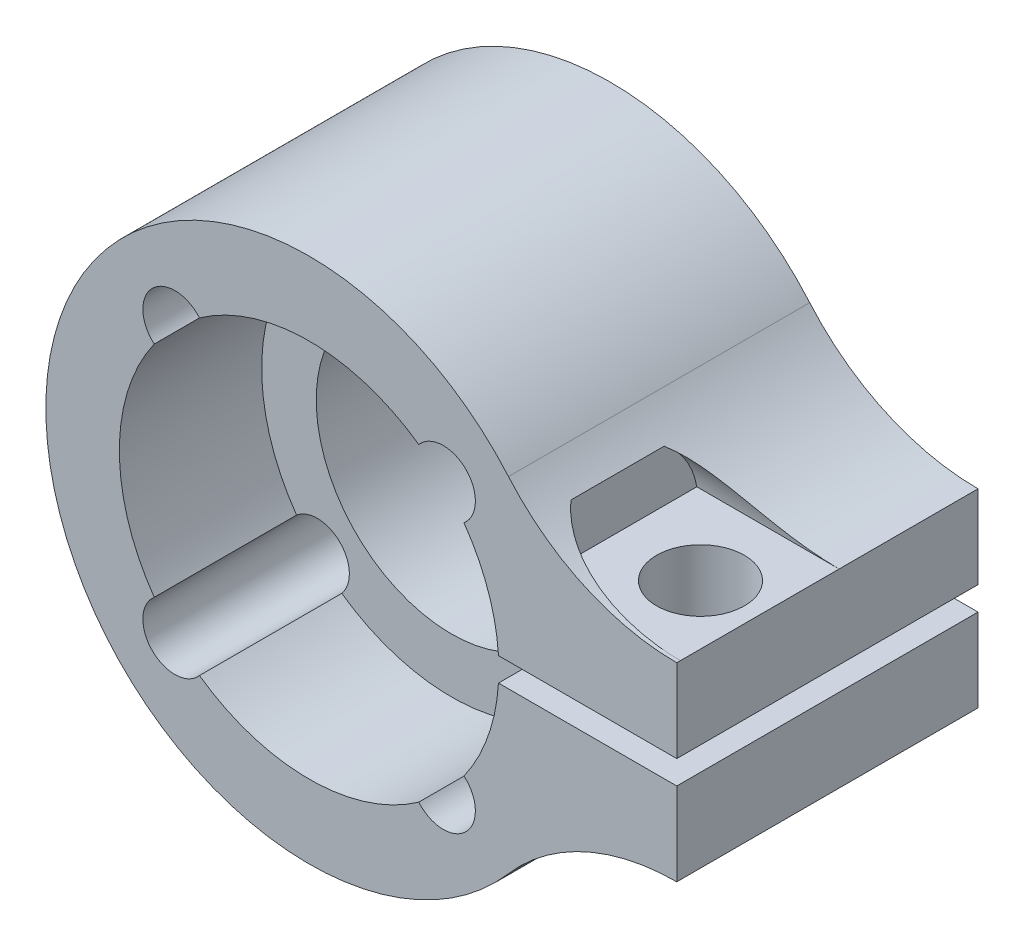
ISO-10303-21;
HEADER;
FILE_DESCRIPTION(('STEP AP214'),'2;1');
FILE_NAME('part.step','',(''),(''),'','','');
FILE_SCHEMA(('AUTOMOTIVE_DESIGN { 1 0 10303 214 1 1 1 1 }'));
ENDSEC;
DATA;
#1=APPLICATION_CONTEXT('core data for automotive mechanical design processes');
#2=APPLICATION_PROTOCOL_DEFINITION('international standard','automotive_design',2000,#1);
#3=PRODUCT_CONTEXT('',#1,'mechanical');
#4=PRODUCT('Part','Part','',(#3));
#5=PRODUCT_RELATED_PRODUCT_CATEGORY('part','',(#4));
#6=PRODUCT_DEFINITION_FORMATION('','',#4);
#7=PRODUCT_DEFINITION_CONTEXT('part definition',#1,'design');
#8=PRODUCT_DEFINITION('design','',#6,#7);
#9=PRODUCT_DEFINITION_SHAPE('','',#8);
#10=(LENGTH_UNIT() NAMED_UNIT(*) SI_UNIT(.MILLI.,.METRE.));
#11=(NAMED_UNIT(*) PLANE_ANGLE_UNIT() SI_UNIT($,.RADIAN.));
#12=(NAMED_UNIT(*) SI_UNIT($,.STERADIAN.) SOLID_ANGLE_UNIT());
#13=UNCERTAINTY_MEASURE_WITH_UNIT(LENGTH_MEASURE(1.E-05),#10,'distance_accuracy_value','');
#14=(GEOMETRIC_REPRESENTATION_CONTEXT(3) GLOBAL_UNCERTAINTY_ASSIGNED_CONTEXT((#13)) GLOBAL_UNIT_ASSIGNED_CONTEXT((#10,
#11,#12)) REPRESENTATION_CONTEXT('',''));
#15=CARTESIAN_POINT('',(0.,0.,0.));
#16=DIRECTION('',(0.,0.,1.));
#17=DIRECTION('',(1.,0.,0.));
#18=AXIS2_PLACEMENT_3D('',#15,#16,#17);
#19=CARTESIAN_POINT('',(0.,0.,-12.7));
#20=DIRECTION('',(0.,0.,1.));
#21=DIRECTION('',(1.,0.,0.));
#22=AXIS2_PLACEMENT_3D('',#19,#20,#21);
#23=CYLINDRICAL_SURFACE('',#22,8.00000000000004);
#24=CARTESIAN_POINT('',(0.,0.,-6.));
#25=DIRECTION('',(0.,0.,1.));
#26=DIRECTION('',(1.,0.,0.));
#27=AXIS2_PLACEMENT_3D('',#24,#25,#26);
#28=CIRCLE('',#27,8.);
#29=CARTESIAN_POINT('',(6.52895071917873,-4.62307284244316,-6.));
#30=VERTEX_POINT('',#29);
#31=CARTESIAN_POINT('',(7.98435971133566,-0.499999999999987,-6.));
#32=VERTEX_POINT('',#31);
#33=EDGE_CURVE('E198',#30,#32,#28,.T.);
#34=ORIENTED_EDGE('',*,*,#33,.F.);
#35=DIRECTION('',(0.,0.,-1.));
#36=VECTOR('',#35,1.);
#37=CARTESIAN_POINT('',(6.52895071917877,-4.62307284244318,-6.35));
#38=LINE('',#37,#36);
#39=CARTESIAN_POINT('',(6.5289507191788,-4.62307284244321,0.));
#40=VERTEX_POINT('',#39);
#41=EDGE_CURVE('E58',#30,#40,#38,.F.);
#42=ORIENTED_EDGE('',*,*,#41,.T.);
#43=CARTESIAN_POINT('',(0.,0.,0.));
#44=DIRECTION('',(0.,0.,1.));
#45=DIRECTION('',(1.,0.,0.));
#46=AXIS2_PLACEMENT_3D('',#43,#44,#45);
#47=CIRCLE('',#46,8.00000000000009);
#48=CARTESIAN_POINT('',(7.98435971133574,-0.500000000000003,0.));
#49=VERTEX_POINT('',#48);
#50=EDGE_CURVE('E196',#40,#49,#47,.T.);
#51=ORIENTED_EDGE('',*,*,#50,.T.);
#52=DIRECTION('',(0.,0.,-1.));
#53=VECTOR('',#52,1.);
#54=CARTESIAN_POINT('',(7.98435971133566,-0.499999999999975,0.));
#55=LINE('',#54,#53);
#56=EDGE_CURVE('E545',#32,#49,#55,.F.);
#57=ORIENTED_EDGE('',*,*,#56,.F.);
#58=EDGE_LOOP('',(#34,#42,#51,#57));
#59=FACE_BOUND('',#58,.T.);
#60=ADVANCED_FACE('F43',(#59),#23,.F.);
#61=CARTESIAN_POINT('',(0.,0.,0.));
#62=DIRECTION('',(0.,0.,1.));
#63=DIRECTION('',(1.,0.,0.));
#64=AXIS2_PLACEMENT_3D('',#61,#62,#63);
#65=PLANE('',#64);
#66=ORIENTED_EDGE('',*,*,#50,.F.);
#67=CARTESIAN_POINT('',(5.656854249492,-5.656854249492,0.));
#68=DIRECTION('',(0.,0.,-1.));
#69=DIRECTION('',(-1.,0.,0.));
#70=AXIS2_PLACEMENT_3D('',#67,#68,#69);
#71=CIRCLE('',#70,1.35249999999999);
#72=CARTESIAN_POINT('',(4.62307284244321,-6.5289507191788,0.));
#73=VERTEX_POINT('',#72);
#74=EDGE_CURVE('E183',#40,#73,#71,.T.);
#75=ORIENTED_EDGE('',*,*,#74,.T.);
#76=CARTESIAN_POINT('',(-4.62307284244321,-6.5289507191788,0.));
#77=VERTEX_POINT('',#76);
#78=EDGE_CURVE('E206',#77,#73,#47,.T.);
#79=ORIENTED_EDGE('',*,*,#78,.F.);
#80=CARTESIAN_POINT('',(-5.656854249492,-5.656854249492,0.));
#81=DIRECTION('',(0.,0.,-1.));
#82=DIRECTION('',(-1.,0.,0.));
#83=AXIS2_PLACEMENT_3D('',#80,#81,#82);
#84=CIRCLE('',#83,1.35249999999999);
#85=CARTESIAN_POINT('',(-6.5289507191788,-4.62307284244321,0.));
#86=VERTEX_POINT('',#85);
#87=EDGE_CURVE('E241',#77,#86,#84,.T.);
#88=ORIENTED_EDGE('',*,*,#87,.T.);
#89=CARTESIAN_POINT('',(-6.5289507191788,4.62307284244321,0.));
#90=VERTEX_POINT('',#89);
#91=EDGE_CURVE('E210',#90,#86,#47,.T.);
#92=ORIENTED_EDGE('',*,*,#91,.F.);
#93=CARTESIAN_POINT('',(-5.656854249492,5.656854249492,0.));
#94=DIRECTION('',(0.,0.,-1.));
#95=DIRECTION('',(-1.,0.,0.));
#96=AXIS2_PLACEMENT_3D('',#93,#94,#95);
#97=CIRCLE('',#96,1.35249999999999);
#98=CARTESIAN_POINT('',(-4.62307284244321,6.5289507191788,0.));
#99=VERTEX_POINT('',#98);
#100=EDGE_CURVE('E240',#90,#99,#97,.T.);
#101=ORIENTED_EDGE('',*,*,#100,.T.);
#102=CARTESIAN_POINT('',(4.62307284244318,6.52895071917877,0.));
#103=VERTEX_POINT('',#102);
#104=EDGE_CURVE('E217',#103,#99,#47,.T.);
#105=ORIENTED_EDGE('',*,*,#104,.F.);
#106=CARTESIAN_POINT('',(5.656854249492,5.656854249492,0.));
#107=DIRECTION('',(0.,0.,-1.));
#108=DIRECTION('',(-1.,0.,0.));
#109=AXIS2_PLACEMENT_3D('',#106,#107,#108);
#110=CIRCLE('',#109,1.35249999999999);
#111=CARTESIAN_POINT('',(6.52895071917877,4.62307284244318,0.));
#112=VERTEX_POINT('',#111);
#113=EDGE_CURVE('E258',#103,#112,#110,.T.);
#114=ORIENTED_EDGE('',*,*,#113,.T.);
#115=CARTESIAN_POINT('',(7.98435971133583,0.5,0.));
#116=VERTEX_POINT('',#115);
#117=EDGE_CURVE('E209',#116,#112,#47,.T.);
#118=ORIENTED_EDGE('',*,*,#117,.F.);
#119=DIRECTION('',(1.,0.,0.));
#120=VECTOR('',#119,1.);
#121=CARTESIAN_POINT('',(0.,0.5,0.));
#122=LINE('',#121,#120);
#123=CARTESIAN_POINT('',(15.5,0.5,0.));
#124=VERTEX_POINT('',#123);
#125=EDGE_CURVE('E734',#116,#124,#122,.T.);
#126=ORIENTED_EDGE('',*,*,#125,.T.);
#127=DIRECTION('',(0.,1.,0.));
#128=VECTOR('',#127,1.);
#129=CARTESIAN_POINT('',(15.5,0.,0.));
#130=LINE('',#129,#128);
#131=CARTESIAN_POINT('',(15.5,4.000000000003,0.));
#132=VERTEX_POINT('',#131);
#133=EDGE_CURVE('E519',#124,#132,#130,.T.);
#134=ORIENTED_EDGE('',*,*,#133,.T.);
#135=CARTESIAN_POINT('',(15.5,13.36901408451,0.));
#136=DIRECTION('',(0.,0.,1.));
#137=DIRECTION('',(1.,0.,0.));
#138=AXIS2_PLACEMENT_3D('',#135,#136,#137);
#139=CIRCLE('',#138,9.369014084507);
#140=CARTESIAN_POINT('',(8.40538773825106,7.24979013280251,0.));
#141=VERTEX_POINT('',#140);
#142=EDGE_CURVE('E523',#132,#141,#139,.F.);
#143=ORIENTED_EDGE('',*,*,#142,.T.);
#144=CARTESIAN_POINT('',(0.,0.,0.));
#145=DIRECTION('',(0.,0.,1.));
#146=DIRECTION('',(1.,0.,0.));
#147=AXIS2_PLACEMENT_3D('',#144,#145,#146);
#148=CIRCLE('',#147,11.1);
#149=CARTESIAN_POINT('',(8.4053877382513,-7.24979013280223,0.));
#150=VERTEX_POINT('',#149);
#151=EDGE_CURVE('E478',#150,#141,#148,.F.);
#152=ORIENTED_EDGE('',*,*,#151,.F.);
#153=CARTESIAN_POINT('',(15.5,-13.36901408451,0.));
#154=DIRECTION('',(0.,0.,1.));
#155=DIRECTION('',(1.,0.,0.));
#156=AXIS2_PLACEMENT_3D('',#153,#154,#155);
#157=CIRCLE('',#156,9.369014084507);
#158=CARTESIAN_POINT('',(15.5,-4.000000000003,0.));
#159=VERTEX_POINT('',#158);
#160=EDGE_CURVE('E503',#150,#159,#157,.F.);
#161=ORIENTED_EDGE('',*,*,#160,.T.);
#162=DIRECTION('',(0.,1.,0.));
#163=VECTOR('',#162,1.);
#164=CARTESIAN_POINT('',(15.5,0.,0.));
#165=LINE('',#164,#163);
#166=CARTESIAN_POINT('',(15.5,-0.5,0.));
#167=VERTEX_POINT('',#166);
#168=EDGE_CURVE('E514',#159,#167,#165,.T.);
#169=ORIENTED_EDGE('',*,*,#168,.T.);
#170=DIRECTION('',(1.,0.,0.));
#171=VECTOR('',#170,1.);
#172=CARTESIAN_POINT('',(0.,-0.5,0.));
#173=LINE('',#172,#171);
#174=EDGE_CURVE('E205',#167,#49,#173,.F.);
#175=ORIENTED_EDGE('',*,*,#174,.T.);
#176=EDGE_LOOP('',(#66,#75,#79,#88,#92,#101,#105,#114,#118,#126,#134,#143,#152,#161,#169,#175));
#177=FACE_BOUND('',#176,.T.);
#178=ADVANCED_FACE('F202',(#177),#65,.T.);
#179=ORIENTED_EDGE('',*,*,#78,.T.);
#180=DIRECTION('',(0.,0.,-1.));
#181=VECTOR('',#180,1.);
#182=CARTESIAN_POINT('',(4.62307284244318,-6.52895071917877,-6.35));
#183=LINE('',#182,#181);
#184=CARTESIAN_POINT('',(4.62307284244316,-6.52895071917873,-6.));
#185=VERTEX_POINT('',#184);
#186=EDGE_CURVE('E186',#73,#185,#183,.T.);
#187=ORIENTED_EDGE('',*,*,#186,.T.);
#188=CARTESIAN_POINT('',(-4.62307284244316,-6.52895071917873,-6.));
#189=VERTEX_POINT('',#188);
#190=EDGE_CURVE('E273',#189,#185,#28,.T.);
#191=ORIENTED_EDGE('',*,*,#190,.F.);
#192=DIRECTION('',(0.,0.,-1.));
#193=VECTOR('',#192,1.);
#194=CARTESIAN_POINT('',(-4.62307284244318,-6.52895071917877,-6.35));
#195=LINE('',#194,#193);
#196=EDGE_CURVE('E65',#189,#77,#195,.F.);
#197=ORIENTED_EDGE('',*,*,#196,.T.);
#198=EDGE_LOOP('',(#179,#187,#191,#197));
#199=FACE_BOUND('',#198,.T.);
#200=ADVANCED_FACE('F316',(#199),#23,.F.);
#201=ORIENTED_EDGE('',*,*,#91,.T.);
#202=DIRECTION('',(0.,0.,-1.));
#203=VECTOR('',#202,1.);
#204=CARTESIAN_POINT('',(-6.52895071917877,-4.62307284244318,-6.35));
#205=LINE('',#204,#203);
#206=CARTESIAN_POINT('',(-6.52895071917873,-4.62307284244316,-6.));
#207=VERTEX_POINT('',#206);
#208=EDGE_CURVE('E235',#86,#207,#205,.T.);
#209=ORIENTED_EDGE('',*,*,#208,.T.);
#210=CARTESIAN_POINT('',(-6.52895071917873,4.62307284244316,-6.));
#211=VERTEX_POINT('',#210);
#212=EDGE_CURVE('E470',#211,#207,#28,.T.);
#213=ORIENTED_EDGE('',*,*,#212,.F.);
#214=DIRECTION('',(0.,0.,-1.));
#215=VECTOR('',#214,1.);
#216=CARTESIAN_POINT('',(-6.52895071917877,4.62307284244318,-6.35));
#217=LINE('',#216,#215);
#218=EDGE_CURVE('E237',#211,#90,#217,.F.);
#219=ORIENTED_EDGE('',*,*,#218,.T.);
#220=EDGE_LOOP('',(#201,#209,#213,#219));
#221=FACE_BOUND('',#220,.T.);
#222=ADVANCED_FACE('F233',(#221),#23,.F.);
#223=ORIENTED_EDGE('',*,*,#104,.T.);
#224=DIRECTION('',(0.,0.,-1.));
#225=VECTOR('',#224,1.);
#226=CARTESIAN_POINT('',(-4.62307284244318,6.52895071917877,-6.35));
#227=LINE('',#226,#225);
#228=CARTESIAN_POINT('',(-4.62307284244316,6.52895071917873,-6.));
#229=VERTEX_POINT('',#228);
#230=EDGE_CURVE('E252',#99,#229,#227,.T.);
#231=ORIENTED_EDGE('',*,*,#230,.T.);
#232=CARTESIAN_POINT('',(4.62307284244316,6.52895071917873,-6.));
#233=VERTEX_POINT('',#232);
#234=EDGE_CURVE('E212',#233,#229,#28,.T.);
#235=ORIENTED_EDGE('',*,*,#234,.F.);
#236=DIRECTION('',(0.,0.,-1.));
#237=VECTOR('',#236,1.);
#238=CARTESIAN_POINT('',(4.62307284244318,6.52895071917877,-6.35));
#239=LINE('',#238,#237);
#240=EDGE_CURVE('E475',#233,#103,#239,.F.);
#241=ORIENTED_EDGE('',*,*,#240,.T.);
#242=EDGE_LOOP('',(#223,#231,#235,#241));
#243=FACE_BOUND('',#242,.T.);
#244=ADVANCED_FACE('F310',(#243),#23,.F.);
#245=CARTESIAN_POINT('',(15.5,4.,-0.1533598938637));
#246=DIRECTION('',(0.,-1.,0.));
#247=DIRECTION('',(0.,0.,-1.));
#248=AXIS2_PLACEMENT_3D('',#245,#246,#247);
#249=PLANE('',#248);
#250=CARTESIAN_POINT('',(13.,4.,-3.5));
#251=DIRECTION('',(0.,-1.,0.));
#252=DIRECTION('',(0.,0.,-1.));
#253=AXIS2_PLACEMENT_3D('',#250,#251,#252);
#254=CIRCLE('',#253,1.84999999999999);
#255=CARTESIAN_POINT('',(13.,4.,-5.34999999999999));
#256=VERTEX_POINT('',#255);
#257=EDGE_CURVE('E462',#256,#256,#254,.T.);
#258=ORIENTED_EDGE('',*,*,#257,.T.);
#259=EDGE_LOOP('',(#258));
#260=FACE_BOUND('',#259,.T.);
#261=DIRECTION('',(0.,0.,-1.));
#262=VECTOR('',#261,1.);
#263=CARTESIAN_POINT('',(9.5,4.,0.));
#264=LINE('',#263,#262);
#265=CARTESIAN_POINT('',(9.5,4.,-0.153359893863698));
#266=VERTEX_POINT('',#265);
#267=CARTESIAN_POINT('',(9.5,4.00000000000003,-6.8466401061363));
#268=VERTEX_POINT('',#267);
#269=EDGE_CURVE('E495',#266,#268,#264,.T.);
#270=ORIENTED_EDGE('',*,*,#269,.F.);
#271=DIRECTION('',(1.,0.,0.));
#272=VECTOR('',#271,1.);
#273=CARTESIAN_POINT('',(15.5,4.,-0.153359893863698));
#274=LINE('',#273,#272);
#275=CARTESIAN_POINT('',(15.5,4.0000000000015,-0.153359893863967));
#276=VERTEX_POINT('',#275);
#277=EDGE_CURVE('E710',#266,#276,#274,.T.);
#278=ORIENTED_EDGE('',*,*,#277,.T.);
#279=DIRECTION('',(0.,0.,-1.));
#280=VECTOR('',#279,1.);
#281=CARTESIAN_POINT('',(15.5,4.,0.));
#282=LINE('',#281,#280);
#283=CARTESIAN_POINT('',(15.5,4.0000000000015,-6.84664010613603));
#284=VERTEX_POINT('',#283);
#285=EDGE_CURVE('E759',#284,#276,#282,.F.);
#286=ORIENTED_EDGE('',*,*,#285,.F.);
#287=DIRECTION('',(1.,0.,0.));
#288=VECTOR('',#287,1.);
#289=CARTESIAN_POINT('',(15.5,4.00000000000005,-6.84664010613629));
#290=LINE('',#289,#288);
#291=EDGE_CURVE('E705',#284,#268,#290,.F.);
#292=ORIENTED_EDGE('',*,*,#291,.T.);
#293=EDGE_LOOP('',(#270,#278,#286,#292));
#294=FACE_BOUND('',#293,.T.);
#295=ADVANCED_FACE('F45',(#260,#294),#249,.F.);
#296=CARTESIAN_POINT('',(9.5,0.,0.));
#297=DIRECTION('',(1.,0.,0.));
#298=DIRECTION('',(0.,0.,-1.));
#299=AXIS2_PLACEMENT_3D('',#296,#297,#298);
#300=PLANE('',#299);
#301=CARTESIAN_POINT('',(9.5,3.4,-3.5));
#302=DIRECTION('',(1.,0.,0.));
#303=DIRECTION('',(0.,0.,-1.));
#304=AXIS2_PLACEMENT_3D('',#301,#302,#303);
#305=CIRCLE('',#304,3.4);
#306=CARTESIAN_POINT('',(9.50000000000113,6.17329140254789,-5.46694046594043));
#307=VERTEX_POINT('',#306);
#308=EDGE_CURVE('E706',#268,#307,#305,.T.);
#309=ORIENTED_EDGE('',*,*,#308,.T.);
#310=DIRECTION('',(0.,0.,1.));
#311=VECTOR('',#310,1.);
#312=CARTESIAN_POINT('',(9.50000000000139,6.17329140254767,0.));
#313=LINE('',#312,#311);
#314=CARTESIAN_POINT('',(9.50000000000069,6.17329140254825,-1.53305953406007));
#315=VERTEX_POINT('',#314);
#316=EDGE_CURVE('E546',#307,#315,#313,.T.);
#317=ORIENTED_EDGE('',*,*,#316,.T.);
#318=CARTESIAN_POINT('',(9.5,3.4,-3.5));
#319=DIRECTION('',(1.,0.,0.));
#320=DIRECTION('',(0.,0.,-1.));
#321=AXIS2_PLACEMENT_3D('',#318,#319,#320);
#322=CIRCLE('',#321,3.4);
#323=EDGE_CURVE('E284',#315,#266,#322,.T.);
#324=ORIENTED_EDGE('',*,*,#323,.T.);
#325=ORIENTED_EDGE('',*,*,#269,.T.);
#326=EDGE_LOOP('',(#309,#317,#324,#325));
#327=FACE_BOUND('',#326,.T.);
#328=ADVANCED_FACE('F430',(#327),#300,.T.);
#329=CARTESIAN_POINT('',(15.5,3.4,-3.5));
#330=DIRECTION('',(1.,0.,0.));
#331=DIRECTION('',(0.,0.,-1.));
#332=AXIS2_PLACEMENT_3D('',#329,#330,#331);
#333=CYLINDRICAL_SURFACE('',#332,3.4);
#334=ORIENTED_EDGE('',*,*,#323,.F.);
#335=CARTESIAN_POINT('',(9.50000000000225,6.17329140254695,-1.53305953405824));
#336=CARTESIAN_POINT('',(9.56622666367728,6.1180370137363,-1.4551611927378));
#337=CARTESIAN_POINT('',(9.63634146561331,6.06115417885342,-1.38190337240806));
#338=CARTESIAN_POINT('',(9.78327810280449,5.94566598238163,-1.24442267295485));
#339=CARTESIAN_POINT('',(9.86008419473906,5.88706486834109,-1.18017946753335));
#340=CARTESIAN_POINT('',(10.018561173192,5.77020829173479,-1.06094475951366));
#341=CARTESIAN_POINT('',(10.1001517025164,5.71195896536398,-1.00583932704456));
#342=CARTESIAN_POINT('',(10.2684068362752,5.59602862932266,-0.903183570749037));
#343=CARTESIAN_POINT('',(10.3550749385397,5.53834804417657,-0.855638540892104));
#344=CARTESIAN_POINT('',(10.5668799136092,5.40258133783093,-0.750524754241013));
#345=CARTESIAN_POINT('',(10.6940132020062,5.32516131815693,-0.69611378206762));
#346=CARTESIAN_POINT('',(10.9550633284042,5.17482725411409,-0.59861807645911));
#347=CARTESIAN_POINT('',(11.0889818273253,5.10191432280602,-0.5555361323358));
#348=CARTESIAN_POINT('',(11.3632757999159,4.96128847829593,-0.478602003829482));
#349=CARTESIAN_POINT('',(11.5036886833984,4.89361389012709,-0.444813929046176));
#350=CARTESIAN_POINT('',(11.7891341195253,4.76480306162264,-0.385141295827844));
#351=CARTESIAN_POINT('',(11.9341681798844,4.70366898415184,-0.359259346632448));
#352=CARTESIAN_POINT('',(12.2986134627055,4.56083144938771,-0.302984980850066));
#353=CARTESIAN_POINT('',(12.5202810259406,4.48335693299805,-0.276399783244031));
#354=CARTESIAN_POINT('',(12.9697511710129,4.34506614412995,-0.233184220398318));
#355=CARTESIAN_POINT('',(13.1975570155685,4.28425893072349,-0.216559262986492));
#356=CARTESIAN_POINT('',(13.6570039926279,4.1800439630974,-0.190255171512575));
#357=CARTESIAN_POINT('',(13.8886365279872,4.1366015977326,-0.180562190066863));
#358=CARTESIAN_POINT('',(14.3545410396705,4.06730588085035,-0.165939197460496));
#359=CARTESIAN_POINT('',(14.5888113881988,4.04144222780131,-0.161006396011537));
#360=CARTESIAN_POINT('',(14.9363093135266,4.01629057264884,-0.156313175954341));
#361=CARTESIAN_POINT('',(15.0490640724919,4.01017695151284,-0.155196925768032));
#362=CARTESIAN_POINT('',(15.2745423088305,4.00203504356906,-0.153723780945709));
#363=CARTESIAN_POINT('',(15.3872655386454,4.00000012638255,-0.153365653844504));
#364=CARTESIAN_POINT('',(15.5,4.000000000003,-0.153359893864236));
#365=B_SPLINE_CURVE_WITH_KNOTS('',3,(#335,#336,#337,#338,#339,#340,#341,#342,#343,#344,#345,
#346,#347,#348,#349,#350,#351,#352,#353,#354,#355,#356,#357,#358,#359,#360,#361,#362,#363,#364),
.UNSPECIFIED.,.F.,.F.,(4,2,2,2,2,2,2,2,2,2,2,2,2,2,4),(0.,0.348320084948475,0.695841697919486,
1.0386375200672,1.38167232875698,1.85638193496831,2.33120830988911,2.80923229975115,
3.2874138807004,3.995335117679,4.7036403669784,5.41052671623285,6.11699845574968,
6.45571140375365,6.7938732888421),.UNSPECIFIED.);
#366=EDGE_CURVE('E581',#315,#276,#365,.T.);
#367=ORIENTED_EDGE('',*,*,#366,.T.);
#368=ORIENTED_EDGE('',*,*,#277,.F.);
#369=EDGE_LOOP('',(#334,#367,#368));
#370=FACE_BOUND('',#369,.T.);
#371=ADVANCED_FACE('F700',(#370),#333,.F.);
#372=CARTESIAN_POINT('',(15.5,3.4,-3.5));
#373=DIRECTION('',(1.,0.,0.));
#374=DIRECTION('',(0.,0.,-1.));
#375=AXIS2_PLACEMENT_3D('',#372,#373,#374);
#376=CYLINDRICAL_SURFACE('',#375,3.4);
#377=ORIENTED_EDGE('',*,*,#291,.F.);
#378=CARTESIAN_POINT('',(15.5,4.000000000003,-6.84664010613576));
#379=CARTESIAN_POINT('',(15.3721209354606,3.99999836615233,-6.84662699427842));
#380=CARTESIAN_POINT('',(15.2442424329339,4.00261816109007,-6.84617035562822));
#381=CARTESIAN_POINT('',(14.9887027067512,4.01308839698853,-6.84427488862142));
#382=CARTESIAN_POINT('',(14.8610414907555,4.02093901867961,-6.84283602632797));
#383=CARTESIAN_POINT('',(14.6060004214517,4.04187190422493,-6.83887846633346));
#384=CARTESIAN_POINT('',(14.47862112706,4.0549607623788,-6.8363584072486));
#385=CARTESIAN_POINT('',(14.2245465948608,4.08634024434201,-6.83004329153201));
#386=CARTESIAN_POINT('',(14.0978513483149,4.10463080154171,-6.82624825122676));
#387=CARTESIAN_POINT('',(13.7169461526609,4.16761589278489,-6.81250253149418));
#388=CARTESIAN_POINT('',(13.4640791742324,4.22024671676423,-6.80021656649102));
#389=CARTESIAN_POINT('',(12.9642784207189,4.34599602845778,-6.76639493067318));
#390=CARTESIAN_POINT('',(12.7173402806902,4.41909890860596,-6.74486629967932));
#391=CARTESIAN_POINT('',(12.3231417054631,4.55359435234935,-6.6987762614618));
#392=CARTESIAN_POINT('',(12.1733424049438,4.60904051047145,-6.67840524745551));
#393=CARTESIAN_POINT('',(11.8776571631968,4.72711728031029,-6.63094524687301));
#394=CARTESIAN_POINT('',(11.7317712266431,4.78974790060753,-6.60385625227339));
#395=CARTESIAN_POINT('',(11.4451744942039,4.92143318619528,-6.54146918415321));
#396=CARTESIAN_POINT('',(11.3044514612793,4.99047107957236,-6.50619219931143));
#397=CARTESIAN_POINT('',(11.0288960868232,5.13422404140248,-6.42562053835148));
#398=CARTESIAN_POINT('',(10.8940615858625,5.20893700070247,-6.38032957211286));
#399=CARTESIAN_POINT('',(10.668226766526,5.34128459557415,-6.29210449849932));
#400=CARTESIAN_POINT('',(10.575489448216,5.39787063710979,-6.25203619375588));
#401=CARTESIAN_POINT('',(10.3943846790275,5.51264115544478,-6.16494569699666));
#402=CARTESIAN_POINT('',(10.3060158651114,5.5708251247401,-6.11792569252126));
#403=CARTESIAN_POINT('',(10.1345945037221,5.68776538084762,-6.01636790700479));
#404=CARTESIAN_POINT('',(10.0515259596556,5.74651926238471,-5.96185448247385));
#405=CARTESIAN_POINT('',(9.89122528628904,5.86368851928003,-5.84458922485136));
#406=CARTESIAN_POINT('',(9.81398881963126,5.92210411576564,-5.78184361109576));
#407=CARTESIAN_POINT('',(9.69780275336919,6.01266892797998,-5.67635517403134));
#408=CARTESIAN_POINT('',(9.6566072287658,6.04536586181725,-5.63653590341782));
#409=CARTESIAN_POINT('',(9.57652143882389,6.10998632758362,-5.55395367777989));
#410=CARTESIAN_POINT('',(9.53763353322012,6.14190904874799,-5.51118780296346));
#411=CARTESIAN_POINT('',(9.50000000000225,6.17329140254695,-5.46694046594176));
#412=B_SPLINE_CURVE_WITH_KNOTS('',3,(#378,#379,#380,#381,#382,#383,#384,#385,#386,#387,#388,
#389,#390,#391,#392,#393,#394,#395,#396,#397,#398,#399,#400,#401,#402,#403,#404,#405,#406,#407,
#408,#409,#410,#411),.UNSPECIFIED.,.F.,.F.,(4,2,2,2,2,2,2,2,2,2,2,2,2,2,2,2,4),(0.,
0.383608235447908,0.76722972563484,1.15133567519462,1.53543670636,2.31012694919618,
3.08422818103955,3.56700819759445,4.04978879074583,4.53133948591985,5.01271207904509,
5.3598264253718,5.70683177435147,6.05273477853938,6.39837794532002,6.59618069046755,
6.79418233842133),.UNSPECIFIED.);
#413=EDGE_CURVE('E586',#284,#307,#412,.T.);
#414=ORIENTED_EDGE('',*,*,#413,.T.);
#415=ORIENTED_EDGE('',*,*,#308,.F.);
#416=EDGE_LOOP('',(#377,#414,#415));
#417=FACE_BOUND('',#416,.T.);
#418=ADVANCED_FACE('F683',(#417),#376,.F.);
#419=CARTESIAN_POINT('',(15.5,-4.,0.));
#420=DIRECTION('',(1.,0.,0.));
#421=DIRECTION('',(0.,0.,-1.));
#422=AXIS2_PLACEMENT_3D('',#419,#420,#421);
#423=PLANE('',#422);
#424=DIRECTION('',(0.,1.,0.));
#425=VECTOR('',#424,1.);
#426=CARTESIAN_POINT('',(15.5,0.,-12.7));
#427=LINE('',#426,#425);
#428=CARTESIAN_POINT('',(15.5,0.5,-12.7));
#429=VERTEX_POINT('',#428);
#430=CARTESIAN_POINT('',(15.5,4.000000000003,-12.7));
#431=VERTEX_POINT('',#430);
#432=EDGE_CURVE('E638',#429,#431,#427,.T.);
#433=ORIENTED_EDGE('',*,*,#432,.T.);
#434=DIRECTION('',(0.,0.,1.));
#435=VECTOR('',#434,1.);
#436=CARTESIAN_POINT('',(15.5,4.000000000003,0.));
#437=LINE('',#436,#435);
#438=EDGE_CURVE('E580',#431,#284,#437,.T.);
#439=ORIENTED_EDGE('',*,*,#438,.T.);
#440=ORIENTED_EDGE('',*,*,#285,.T.);
#441=DIRECTION('',(0.,0.,1.));
#442=VECTOR('',#441,1.);
#443=CARTESIAN_POINT('',(15.5,4.000000000003,0.));
#444=LINE('',#443,#442);
#445=EDGE_CURVE('E576',#276,#132,#444,.T.);
#446=ORIENTED_EDGE('',*,*,#445,.T.);
#447=ORIENTED_EDGE('',*,*,#133,.F.);
#448=DIRECTION('',(0.,0.,1.));
#449=VECTOR('',#448,1.);
#450=CARTESIAN_POINT('',(15.5,0.5,0.));
#451=LINE('',#450,#449);
#452=EDGE_CURVE('E544',#124,#429,#451,.F.);
#453=ORIENTED_EDGE('',*,*,#452,.T.);
#454=EDGE_LOOP('',(#433,#439,#440,#446,#447,#453));
#455=FACE_BOUND('',#454,.T.);
#456=ADVANCED_FACE('F694',(#455),#423,.T.);
#457=CARTESIAN_POINT('',(15.5,-4.,0.));
#458=DIRECTION('',(1.,0.,0.));
#459=DIRECTION('',(0.,0.,-1.));
#460=AXIS2_PLACEMENT_3D('',#457,#458,#459);
#461=PLANE('',#460);
#462=DIRECTION('',(0.,1.,0.));
#463=VECTOR('',#462,1.);
#464=CARTESIAN_POINT('',(15.5,0.,-12.7));
#465=LINE('',#464,#463);
#466=CARTESIAN_POINT('',(15.5,-4.000000000003,-12.7));
#467=VERTEX_POINT('',#466);
#468=CARTESIAN_POINT('',(15.5,-0.5,-12.7));
#469=VERTEX_POINT('',#468);
#470=EDGE_CURVE('E633',#467,#469,#465,.T.);
#471=ORIENTED_EDGE('',*,*,#470,.T.);
#472=DIRECTION('',(0.,0.,-1.));
#473=VECTOR('',#472,1.);
#474=CARTESIAN_POINT('',(15.5,-0.5,0.));
#475=LINE('',#474,#473);
#476=EDGE_CURVE('E757',#469,#167,#475,.F.);
#477=ORIENTED_EDGE('',*,*,#476,.T.);
#478=ORIENTED_EDGE('',*,*,#168,.F.);
#479=DIRECTION('',(0.,0.,1.));
#480=VECTOR('',#479,1.);
#481=CARTESIAN_POINT('',(15.5,-4.000000000003,0.));
#482=LINE('',#481,#480);
#483=EDGE_CURVE('E742',#159,#467,#482,.F.);
#484=ORIENTED_EDGE('',*,*,#483,.T.);
#485=EDGE_LOOP('',(#471,#477,#478,#484));
#486=FACE_BOUND('',#485,.T.);
#487=ADVANCED_FACE('F691',(#486),#461,.T.);
#488=CARTESIAN_POINT('',(0.,-0.5,0.));
#489=DIRECTION('',(0.,-1.,0.));
#490=DIRECTION('',(0.,0.,-1.));
#491=AXIS2_PLACEMENT_3D('',#488,#489,#490);
#492=PLANE('',#491);
#493=CARTESIAN_POINT('',(13.,-0.499999999999999,-3.5));
#494=DIRECTION('',(0.,1.,0.));
#495=DIRECTION('',(0.,0.,1.));
#496=AXIS2_PLACEMENT_3D('',#493,#494,#495);
#497=CIRCLE('',#496,1.35249999999999);
#498=CARTESIAN_POINT('',(13.,-0.499999999999999,-2.14750000000001));
#499=VERTEX_POINT('',#498);
#500=EDGE_CURVE('E264',#499,#499,#497,.T.);
#501=ORIENTED_EDGE('',*,*,#500,.F.);
#502=EDGE_LOOP('',(#501));
#503=FACE_BOUND('',#502,.T.);
#504=DIRECTION('',(1.,0.,0.));
#505=VECTOR('',#504,1.);
#506=CARTESIAN_POINT('',(0.,-0.5,-12.7));
#507=LINE('',#506,#505);
#508=CARTESIAN_POINT('',(5.67802782663118,-0.5,-12.7));
#509=VERTEX_POINT('',#508);
#510=EDGE_CURVE('E636',#469,#509,#507,.F.);
#511=ORIENTED_EDGE('',*,*,#510,.T.);
#512=DIRECTION('',(0.,0.,-1.));
#513=VECTOR('',#512,1.);
#514=CARTESIAN_POINT('',(5.67802782663118,-0.5,-6.));
#515=LINE('',#514,#513);
#516=CARTESIAN_POINT('',(5.67802782663118,-0.5,-6.));
#517=VERTEX_POINT('',#516);
#518=EDGE_CURVE('E773',#517,#509,#515,.T.);
#519=ORIENTED_EDGE('',*,*,#518,.F.);
#520=DIRECTION('',(-1.,0.,0.));
#521=VECTOR('',#520,1.);
#522=CARTESIAN_POINT('',(7.98435971133566,-0.499999999999987,-6.));
#523=LINE('',#522,#521);
#524=EDGE_CURVE('E222',#32,#517,#523,.T.);
#525=ORIENTED_EDGE('',*,*,#524,.F.);
#526=ORIENTED_EDGE('',*,*,#56,.T.);
#527=ORIENTED_EDGE('',*,*,#174,.F.);
#528=ORIENTED_EDGE('',*,*,#476,.F.);
#529=EDGE_LOOP('',(#511,#519,#525,#526,#527,#528));
#530=FACE_BOUND('',#529,.T.);
#531=ADVANCED_FACE('F442',(#503,#530),#492,.F.);
#532=CARTESIAN_POINT('',(15.5,0.5,0.));
#533=DIRECTION('',(0.,1.,0.));
#534=DIRECTION('',(0.,0.,1.));
#535=AXIS2_PLACEMENT_3D('',#532,#533,#534);
#536=PLANE('',#535);
#537=CARTESIAN_POINT('',(13.,0.499999999999999,-3.5));
#538=DIRECTION('',(0.,-1.,0.));
#539=DIRECTION('',(0.,0.,-1.));
#540=AXIS2_PLACEMENT_3D('',#537,#538,#539);
#541=CIRCLE('',#540,1.84999999999999);
#542=CARTESIAN_POINT('',(13.,0.499999999999999,-5.34999999999999));
#543=VERTEX_POINT('',#542);
#544=EDGE_CURVE('E459',#543,#543,#541,.T.);
#545=ORIENTED_EDGE('',*,*,#544,.F.);
#546=EDGE_LOOP('',(#545));
#547=FACE_BOUND('',#546,.T.);
#548=DIRECTION('',(0.,0.,1.));
#549=VECTOR('',#548,1.);
#550=CARTESIAN_POINT('',(7.984359711336,0.5,0.));
#551=LINE('',#550,#549);
#552=CARTESIAN_POINT('',(7.98435971133566,0.499999999999979,-6.));
#553=VERTEX_POINT('',#552);
#554=EDGE_CURVE('E540',#553,#116,#551,.T.);
#555=ORIENTED_EDGE('',*,*,#554,.F.);
#556=DIRECTION('',(1.,0.,0.));
#557=VECTOR('',#556,1.);
#558=CARTESIAN_POINT('',(5.67802782663118,0.5,-6.));
#559=LINE('',#558,#557);
#560=CARTESIAN_POINT('',(5.67802782663118,0.499999999999998,-6.));
#561=VERTEX_POINT('',#560);
#562=EDGE_CURVE('E776',#561,#553,#559,.T.);
#563=ORIENTED_EDGE('',*,*,#562,.F.);
#564=DIRECTION('',(0.,0.,-1.));
#565=VECTOR('',#564,1.);
#566=CARTESIAN_POINT('',(5.67802782663118,0.499999999999998,-6.));
#567=LINE('',#566,#565);
#568=CARTESIAN_POINT('',(5.67802782663118,0.499999999999998,-12.7));
#569=VERTEX_POINT('',#568);
#570=EDGE_CURVE('E771',#561,#569,#567,.T.);
#571=ORIENTED_EDGE('',*,*,#570,.T.);
#572=DIRECTION('',(1.,0.,0.));
#573=VECTOR('',#572,1.);
#574=CARTESIAN_POINT('',(0.,0.5,-12.7));
#575=LINE('',#574,#573);
#576=EDGE_CURVE('E587',#569,#429,#575,.T.);
#577=ORIENTED_EDGE('',*,*,#576,.T.);
#578=ORIENTED_EDGE('',*,*,#452,.F.);
#579=ORIENTED_EDGE('',*,*,#125,.F.);
#580=EDGE_LOOP('',(#555,#563,#571,#577,#578,#579));
#581=FACE_BOUND('',#580,.T.);
#582=ADVANCED_FACE('F438',(#547,#581),#536,.F.);
#583=CARTESIAN_POINT('',(15.5,13.36901408451,0.));
#584=DIRECTION('',(0.,0.,1.));
#585=DIRECTION('',(1.,0.,0.));
#586=AXIS2_PLACEMENT_3D('',#583,#584,#585);
#587=CYLINDRICAL_SURFACE('',#586,9.369014084507);
#588=ORIENTED_EDGE('',*,*,#438,.F.);
#589=CARTESIAN_POINT('',(15.5,13.36901408451,-12.7));
#590=DIRECTION('',(0.,0.,1.));
#591=DIRECTION('',(1.,0.,0.));
#592=AXIS2_PLACEMENT_3D('',#589,#590,#591);
#593=CIRCLE('',#592,9.369014084507);
#594=CARTESIAN_POINT('',(8.40538773825106,7.24979013280251,-12.7));
#595=VERTEX_POINT('',#594);
#596=EDGE_CURVE('E637',#431,#595,#593,.F.);
#597=ORIENTED_EDGE('',*,*,#596,.T.);
#598=DIRECTION('',(0.,0.,1.));
#599=VECTOR('',#598,1.);
#600=CARTESIAN_POINT('',(8.40538773825054,7.2497901328016,0.));
#601=LINE('',#600,#599);
#602=EDGE_CURVE('E502',#141,#595,#601,.F.);
#603=ORIENTED_EDGE('',*,*,#602,.F.);
#604=ORIENTED_EDGE('',*,*,#142,.F.);
#605=ORIENTED_EDGE('',*,*,#445,.F.);
#606=ORIENTED_EDGE('',*,*,#366,.F.);
#607=ORIENTED_EDGE('',*,*,#316,.F.);
#608=ORIENTED_EDGE('',*,*,#413,.F.);
#609=EDGE_LOOP('',(#588,#597,#603,#604,#605,#606,#607,#608));
#610=FACE_BOUND('',#609,.T.);
#611=ADVANCED_FACE('F365',(#610),#587,.F.);
#612=CARTESIAN_POINT('',(0.,0.,-12.7));
#613=DIRECTION('',(0.,0.,1.));
#614=DIRECTION('',(1.,0.,0.));
#615=AXIS2_PLACEMENT_3D('',#612,#613,#614);
#616=PLANE('',#615);
#617=CARTESIAN_POINT('',(5.656854249492,-5.656854249492,-12.7));
#618=DIRECTION('',(0.,0.,-1.));
#619=DIRECTION('',(-1.,0.,0.));
#620=AXIS2_PLACEMENT_3D('',#617,#618,#619);
#621=CIRCLE('',#620,1.35249999999999);
#622=CARTESIAN_POINT('',(4.30435424949201,-5.656854249492,-12.7));
#623=VERTEX_POINT('',#622);
#624=EDGE_CURVE('E191',#623,#623,#621,.T.);
#625=ORIENTED_EDGE('',*,*,#624,.F.);
#626=EDGE_LOOP('',(#625));
#627=FACE_BOUND('',#626,.T.);
#628=CARTESIAN_POINT('',(-5.656854249492,-5.656854249492,-12.7));
#629=DIRECTION('',(0.,0.,-1.));
#630=DIRECTION('',(-1.,0.,0.));
#631=AXIS2_PLACEMENT_3D('',#628,#629,#630);
#632=CIRCLE('',#631,1.35249999999999);
#633=CARTESIAN_POINT('',(-7.00935424949199,-5.656854249492,-12.7));
#634=VERTEX_POINT('',#633);
#635=EDGE_CURVE('E199',#634,#634,#632,.T.);
#636=ORIENTED_EDGE('',*,*,#635,.F.);
#637=EDGE_LOOP('',(#636));
#638=FACE_BOUND('',#637,.T.);
#639=CARTESIAN_POINT('',(-5.656854249492,5.656854249492,-12.7));
#640=DIRECTION('',(0.,0.,-1.));
#641=DIRECTION('',(-1.,0.,0.));
#642=AXIS2_PLACEMENT_3D('',#639,#640,#641);
#643=CIRCLE('',#642,1.35249999999999);
#644=CARTESIAN_POINT('',(-7.00935424949199,5.656854249492,-12.7));
#645=VERTEX_POINT('',#644);
#646=EDGE_CURVE('E248',#645,#645,#643,.T.);
#647=ORIENTED_EDGE('',*,*,#646,.F.);
#648=EDGE_LOOP('',(#647));
#649=FACE_BOUND('',#648,.T.);
#650=CARTESIAN_POINT('',(5.656854249492,5.656854249492,-12.7));
#651=DIRECTION('',(0.,0.,-1.));
#652=DIRECTION('',(-1.,0.,0.));
#653=AXIS2_PLACEMENT_3D('',#650,#651,#652);
#654=CIRCLE('',#653,1.35249999999999);
#655=CARTESIAN_POINT('',(4.30435424949201,5.656854249492,-12.7));
#656=VERTEX_POINT('',#655);
#657=EDGE_CURVE('E255',#656,#656,#654,.T.);
#658=ORIENTED_EDGE('',*,*,#657,.F.);
#659=EDGE_LOOP('',(#658));
#660=FACE_BOUND('',#659,.T.);
#661=ORIENTED_EDGE('',*,*,#576,.F.);
#662=CARTESIAN_POINT('',(0.,0.,-12.7));
#663=DIRECTION('',(0.,0.,1.));
#664=DIRECTION('',(1.,0.,0.));
#665=AXIS2_PLACEMENT_3D('',#662,#663,#664);
#666=CIRCLE('',#665,5.69999999999982);
#667=EDGE_CURVE('E216',#569,#509,#666,.T.);
#668=ORIENTED_EDGE('',*,*,#667,.T.);
#669=ORIENTED_EDGE('',*,*,#510,.F.);
#670=ORIENTED_EDGE('',*,*,#470,.F.);
#671=CARTESIAN_POINT('',(15.5,-13.36901408451,-12.7));
#672=DIRECTION('',(0.,0.,1.));
#673=DIRECTION('',(1.,0.,0.));
#674=AXIS2_PLACEMENT_3D('',#671,#672,#673);
#675=CIRCLE('',#674,9.369014084507);
#676=CARTESIAN_POINT('',(8.4053877382513,-7.24979013280223,-12.7));
#677=VERTEX_POINT('',#676);
#678=EDGE_CURVE('E524',#467,#677,#675,.T.);
#679=ORIENTED_EDGE('',*,*,#678,.T.);
#680=CARTESIAN_POINT('',(0.,0.,-12.7));
#681=DIRECTION('',(0.,0.,1.));
#682=DIRECTION('',(1.,0.,0.));
#683=AXIS2_PLACEMENT_3D('',#680,#681,#682);
#684=CIRCLE('',#683,11.1);
#685=EDGE_CURVE('E491',#595,#677,#684,.T.);
#686=ORIENTED_EDGE('',*,*,#685,.F.);
#687=ORIENTED_EDGE('',*,*,#596,.F.);
#688=ORIENTED_EDGE('',*,*,#432,.F.);
#689=EDGE_LOOP('',(#661,#668,#669,#670,#679,#686,#687,#688));
#690=FACE_BOUND('',#689,.T.);
#691=ADVANCED_FACE('F360',(#627,#638,#649,#660,#690),#616,.F.);
#692=CARTESIAN_POINT('',(15.5,-13.36901408451,0.));
#693=DIRECTION('',(0.,0.,1.));
#694=DIRECTION('',(1.,0.,0.));
#695=AXIS2_PLACEMENT_3D('',#692,#693,#694);
#696=CYLINDRICAL_SURFACE('',#695,9.369014084507);
#697=CARTESIAN_POINT('',(13.,-4.33970486864578,-2.14750000000001));
#698=CARTESIAN_POINT('',(13.075699499903,-4.31874650731044,-2.14750241317987));
#699=CARTESIAN_POINT('',(13.1516988260145,-4.29873793842817,-2.15387153594537));
#700=CARTESIAN_POINT('',(13.3021524351859,-4.26111014242704,-2.17947437385769));
#701=CARTESIAN_POINT('',(13.3766058285907,-4.2434922604984,-2.19871529589249));
#702=CARTESIAN_POINT('',(13.521777531839,-4.21092465104743,-2.24982779877062));
#703=CARTESIAN_POINT('',(13.5924915651592,-4.19597793384358,-2.28171350128464));
#704=CARTESIAN_POINT('',(13.7278133530534,-4.16887566548482,-2.35739261638288));
#705=CARTESIAN_POINT('',(13.7924223128774,-4.15671956273283,-2.40118367199274));
#706=CARTESIAN_POINT('',(13.9119601068757,-4.13537121737492,-2.49831424813485));
#707=CARTESIAN_POINT('',(13.9670834202459,-4.12611507154355,-2.55140049440523));
#708=CARTESIAN_POINT('',(14.0677339293353,-4.10998369753986,-2.66631351452311));
#709=CARTESIAN_POINT('',(14.1132616856076,-4.10310833027215,-2.72813977744372));
#710=CARTESIAN_POINT('',(14.1926909926066,-4.09157038819688,-2.85778509497004));
#711=CARTESIAN_POINT('',(14.2267528946227,-4.08687691093423,-2.92550323850449));
#712=CARTESIAN_POINT('',(14.2831232431967,-4.07931820851871,-3.06576152724298));
#713=CARTESIAN_POINT('',(14.3054319552011,-4.07645294207529,-3.13830156350264));
#714=CARTESIAN_POINT('',(14.3375794193983,-4.0723766355848,-3.28592424777137));
#715=CARTESIAN_POINT('',(14.3474529555552,-4.07116098046447,-3.36099919748687));
#716=CARTESIAN_POINT('',(14.3545524548462,-4.07028361691239,-3.51175394730041));
#717=CARTESIAN_POINT('',(14.3517784253406,-4.07062190757631,-3.58743374704643));
#718=CARTESIAN_POINT('',(14.3336634572163,-4.07287694814128,-3.73726133379034));
#719=CARTESIAN_POINT('',(14.3183206911463,-4.07479392757848,-3.81140889639882));
#720=CARTESIAN_POINT('',(14.275523010569,-4.08033587926363,-3.95605436075149));
#721=CARTESIAN_POINT('',(14.2480682004758,-4.08396083678766,-4.0265522939521));
#722=CARTESIAN_POINT('',(14.1818774210161,-4.09312661910912,-4.16188755593259));
#723=CARTESIAN_POINT('',(14.1431432251149,-4.09866714274646,-4.22672577251197));
#724=CARTESIAN_POINT('',(14.0555723398964,-4.11190828217523,-4.34892484364106));
#725=CARTESIAN_POINT('',(14.0067358810911,-4.11960884868056,-4.40628586875553));
#726=CARTESIAN_POINT('',(13.9004094737172,-4.13740339060147,-4.51200024143113));
#727=CARTESIAN_POINT('',(13.8429113492958,-4.14749963255916,-4.56034498087535));
#728=CARTESIAN_POINT('',(13.7210649978094,-4.17022883412698,-4.64668990460917));
#729=CARTESIAN_POINT('',(13.6567166952322,-4.18286182170206,-4.6846899748488));
#730=CARTESIAN_POINT('',(13.5225225872578,-4.21080788309844,-4.74973401137818));
#731=CARTESIAN_POINT('',(13.4526333584402,-4.22614357944432,-4.77667854524154));
#732=CARTESIAN_POINT('',(13.3099201717937,-4.25927526708968,-4.81861278988562));
#733=CARTESIAN_POINT('',(13.237095887859,-4.2770715323131,-4.83360116838264));
#734=CARTESIAN_POINT('',(13.0886693151053,-4.31528959846555,-4.85171176481998));
#735=CARTESIAN_POINT('',(13.0130434441236,-4.3357665988002,-4.85452296931947));
#736=CARTESIAN_POINT('',(12.862863568531,-4.37846145142969,-4.84762912339162));
#737=CARTESIAN_POINT('',(12.788309793106,-4.40067966959156,-4.83792143581928));
#738=CARTESIAN_POINT('',(12.6392788027278,-4.44707349794521,-4.80582187012907));
#739=CARTESIAN_POINT('',(12.564918207012,-4.47129166150457,-4.78294959428555));
#740=CARTESIAN_POINT('',(12.4212522466296,-4.51997472250858,-4.72487309731273));
#741=CARTESIAN_POINT('',(12.351948136932,-4.5444396795015,-4.68966582725669));
#742=CARTESIAN_POINT('',(12.2183945112668,-4.59321321949958,-4.60665931386725));
#743=CARTESIAN_POINT('',(12.1543310146797,-4.61749990944266,-4.55854694257493));
#744=CARTESIAN_POINT('',(12.03526994414,-4.66394885344684,-4.45129890021944));
#745=CARTESIAN_POINT('',(11.9802722937988,-4.68611112540759,-4.39216332204663));
#746=CARTESIAN_POINT('',(11.8823391201135,-4.72646221643437,-4.26572644637026));
#747=CARTESIAN_POINT('',(11.8391571034672,-4.74473013010141,-4.19864214424123));
#748=CARTESIAN_POINT('',(11.7649562611502,-4.77660379931679,-4.05704581185129));
#749=CARTESIAN_POINT('',(11.7339298306814,-4.79021246911475,-3.9825384623283));
#750=CARTESIAN_POINT('',(11.6873415766959,-4.81082133168857,-3.83429764180702));
#751=CARTESIAN_POINT('',(11.670782713786,-4.81824556119657,-3.76093663199757));
#752=CARTESIAN_POINT('',(11.6500697791422,-4.82755065044055,-3.61215001022348));
#753=CARTESIAN_POINT('',(11.6459095907737,-4.8294342435312,-3.53672543481728));
#754=CARTESIAN_POINT('',(11.6500395551484,-4.82757226441537,-3.39144583446087));
#755=CARTESIAN_POINT('',(11.6575029110633,-4.82420049913159,-3.3215606108998));
#756=CARTESIAN_POINT('',(11.6830392625642,-4.8127632150895,-3.18416307994182));
#757=CARTESIAN_POINT('',(11.7011122247265,-4.80469771111804,-3.11665076507018));
#758=CARTESIAN_POINT('',(11.7472072577375,-4.78439984989904,-2.9856011739614));
#759=CARTESIAN_POINT('',(11.775254882106,-4.77215679371417,-2.92207460495899));
#760=CARTESIAN_POINT('',(11.840313383861,-4.74426089224471,-2.8006195165305));
#761=CARTESIAN_POINT('',(11.8773262913679,-4.7286072747452,-2.74269226919074));
#762=CARTESIAN_POINT('',(11.961946976681,-4.69359864313478,-2.62994625704661));
#763=CARTESIAN_POINT('',(12.0100941993038,-4.67406712002904,-2.57558765017154));
#764=CARTESIAN_POINT('',(12.1140097961035,-4.63307599414232,-2.47555648428065));
#765=CARTESIAN_POINT('',(12.1697823304407,-4.61161534108546,-2.42988869949562));
#766=CARTESIAN_POINT('',(12.2920910599283,-4.56604203947241,-2.34497729489366));
#767=CARTESIAN_POINT('',(12.3591237918696,-4.54185196984623,-2.30648946412754));
#768=CARTESIAN_POINT('',(12.4986999967804,-4.49342581772697,-2.24147902948221));
#769=CARTESIAN_POINT('',(12.5712399642213,-4.4691897739209,-2.21494888754429));
#770=CARTESIAN_POINT('',(12.703077346849,-4.42701768818315,-2.17915110455261));
#771=CARTESIAN_POINT('',(12.7616368033747,-4.4089018640378,-2.16733033383005));
#772=CARTESIAN_POINT('',(12.8800679585384,-4.37355970839872,-2.1515039640226));
#773=CARTESIAN_POINT('',(12.9399396101568,-4.35633334510715,-2.14749808537016));
#774=CARTESIAN_POINT('',(13.,-4.33970486864578,-2.14750000000001));
#775=B_SPLINE_CURVE_WITH_KNOTS('',3,(#697,#698,#699,#700,#701,#702,#703,#704,#705,#706,#707,
#708,#709,#710,#711,#712,#713,#714,#715,#716,#717,#718,#719,#720,#721,#722,#723,#724,#725,#726,
#727,#728,#729,#730,#731,#732,#733,#734,#735,#736,#737,#738,#739,#740,#741,#742,#743,#744,#745,
#746,#747,#748,#749,#750,#751,#752,#753,#754,#755,#756,#757,#758,#759,#760,#761,#762,#763,#764,
#765,#766,#767,#768,#769,#770,#771,#772,#773,#774),.UNSPECIFIED.,.T.,.F.,(4,2,2,2,2,2,2,2,2,2,2,
2,2,2,2,2,2,2,2,2,2,2,2,2,2,2,2,2,2,2,2,2,2,2,2,2,2,2,4),(0.,0.235427825629779,
0.470987577150653,0.706811145649162,0.942588060692807,1.17272885309509,1.40285619740707,
1.6296166775796,1.85637203613455,2.08249169027154,2.30861121281687,2.53476361820436,
2.76091407404218,2.98702899127641,3.21313874962327,3.43946328880051,3.66579032310452,
3.8941105146653,4.12245614457031,4.35660072382529,4.59079463444895,4.83413152685206,
5.07752860901972,5.32747034734337,5.57740997955308,5.82164924096801,6.06573545606856,
6.29124981437175,6.51665290130827,6.72673976158956,6.9368259600307,7.14745429000591,
7.35813035982866,7.58276322407161,7.80751913453243,8.0494199196332,8.29116799784511,
8.47796438182053,8.6647540832766),.UNSPECIFIED.);
#776=CARTESIAN_POINT('',(13.,-4.33970486864578,-2.14750000000001));
#777=VERTEX_POINT('',#776);
#778=EDGE_CURVE('E267',#777,#777,#775,.T.);
#779=ORIENTED_EDGE('',*,*,#778,.T.);
#780=EDGE_LOOP('',(#779));
#781=FACE_BOUND('',#780,.T.);
#782=ORIENTED_EDGE('',*,*,#678,.F.);
#783=ORIENTED_EDGE('',*,*,#483,.F.);
#784=ORIENTED_EDGE('',*,*,#160,.F.);
#785=DIRECTION('',(0.,0.,1.));
#786=VECTOR('',#785,1.);
#787=CARTESIAN_POINT('',(8.40538773825103,-7.24979013280103,0.));
#788=LINE('',#787,#786);
#789=EDGE_CURVE('E482',#677,#150,#788,.T.);
#790=ORIENTED_EDGE('',*,*,#789,.F.);
#791=EDGE_LOOP('',(#782,#783,#784,#790));
#792=FACE_BOUND('',#791,.T.);
#793=ADVANCED_FACE('F289',(#781,#792),#696,.F.);
#794=CARTESIAN_POINT('',(0.,0.,0.));
#795=DIRECTION('',(0.,0.,1.));
#796=DIRECTION('',(1.,0.,0.));
#797=AXIS2_PLACEMENT_3D('',#794,#795,#796);
#798=CYLINDRICAL_SURFACE('',#797,11.1);
#799=ORIENTED_EDGE('',*,*,#789,.T.);
#800=ORIENTED_EDGE('',*,*,#151,.T.);
#801=ORIENTED_EDGE('',*,*,#602,.T.);
#802=ORIENTED_EDGE('',*,*,#685,.T.);
#803=EDGE_LOOP('',(#799,#800,#801,#802));
#804=FACE_BOUND('',#803,.T.);
#805=ADVANCED_FACE('F306',(#804),#798,.T.);
#806=CARTESIAN_POINT('',(8.,0.,-6.));
#807=DIRECTION('',(0.,0.,-1.));
#808=DIRECTION('',(-1.,0.,0.));
#809=AXIS2_PLACEMENT_3D('',#806,#807,#808);
#810=PLANE('',#809);
#811=ORIENTED_EDGE('',*,*,#190,.T.);
#812=CARTESIAN_POINT('',(5.656854249492,-5.656854249492,-6.));
#813=DIRECTION('',(0.,0.,-1.));
#814=DIRECTION('',(-1.,0.,0.));
#815=AXIS2_PLACEMENT_3D('',#812,#813,#814);
#816=CIRCLE('',#815,1.35249999999999);
#817=EDGE_CURVE('E13',#185,#30,#816,.T.);
#818=ORIENTED_EDGE('',*,*,#817,.T.);
#819=ORIENTED_EDGE('',*,*,#33,.T.);
#820=ORIENTED_EDGE('',*,*,#524,.T.);
#821=CARTESIAN_POINT('',(0.,0.,-6.));
#822=DIRECTION('',(0.,0.,1.));
#823=DIRECTION('',(1.,0.,0.));
#824=AXIS2_PLACEMENT_3D('',#821,#822,#823);
#825=CIRCLE('',#824,5.69999999999982);
#826=EDGE_CURVE('E268',#561,#517,#825,.T.);
#827=ORIENTED_EDGE('',*,*,#826,.F.);
#828=ORIENTED_EDGE('',*,*,#562,.T.);
#829=CARTESIAN_POINT('',(6.52895071917874,4.62307284244316,-6.));
#830=VERTEX_POINT('',#829);
#831=EDGE_CURVE('E207',#553,#830,#28,.T.);
#832=ORIENTED_EDGE('',*,*,#831,.T.);
#833=CARTESIAN_POINT('',(5.656854249492,5.656854249492,-6.));
#834=DIRECTION('',(0.,0.,-1.));
#835=DIRECTION('',(-1.,0.,0.));
#836=AXIS2_PLACEMENT_3D('',#833,#834,#835);
#837=CIRCLE('',#836,1.35249999999999);
#838=EDGE_CURVE('E261',#830,#233,#837,.T.);
#839=ORIENTED_EDGE('',*,*,#838,.T.);
#840=ORIENTED_EDGE('',*,*,#234,.T.);
#841=CARTESIAN_POINT('',(-5.656854249492,5.656854249492,-6.));
#842=DIRECTION('',(0.,0.,-1.));
#843=DIRECTION('',(-1.,0.,0.));
#844=AXIS2_PLACEMENT_3D('',#841,#842,#843);
#845=CIRCLE('',#844,1.35249999999999);
#846=EDGE_CURVE('E474',#229,#211,#845,.T.);
#847=ORIENTED_EDGE('',*,*,#846,.T.);
#848=ORIENTED_EDGE('',*,*,#212,.T.);
#849=CARTESIAN_POINT('',(-5.656854249492,-5.656854249492,-6.));
#850=DIRECTION('',(0.,0.,-1.));
#851=DIRECTION('',(-1.,0.,0.));
#852=AXIS2_PLACEMENT_3D('',#849,#850,#851);
#853=CIRCLE('',#852,1.35249999999999);
#854=EDGE_CURVE('E51',#207,#189,#853,.T.);
#855=ORIENTED_EDGE('',*,*,#854,.T.);
#856=EDGE_LOOP('',(#811,#818,#819,#820,#827,#828,#832,#839,#840,#847,#848,#855));
#857=FACE_BOUND('',#856,.T.);
#858=ADVANCED_FACE('F302',(#857),#810,.F.);
#859=CARTESIAN_POINT('',(0.,0.,-12.7));
#860=DIRECTION('',(0.,0.,1.));
#861=DIRECTION('',(1.,0.,0.));
#862=AXIS2_PLACEMENT_3D('',#859,#860,#861);
#863=CYLINDRICAL_SURFACE('',#862,5.69999999999982);
#864=ORIENTED_EDGE('',*,*,#667,.F.);
#865=ORIENTED_EDGE('',*,*,#570,.F.);
#866=ORIENTED_EDGE('',*,*,#826,.T.);
#867=ORIENTED_EDGE('',*,*,#518,.T.);
#868=EDGE_LOOP('',(#864,#865,#866,#867));
#869=FACE_BOUND('',#868,.T.);
#870=ADVANCED_FACE('F305',(#869),#863,.F.);
#871=ORIENTED_EDGE('',*,*,#117,.T.);
#872=DIRECTION('',(0.,0.,-1.));
#873=VECTOR('',#872,1.);
#874=CARTESIAN_POINT('',(6.52895071917877,4.62307284244318,-6.35));
#875=LINE('',#874,#873);
#876=EDGE_CURVE('E287',#112,#830,#875,.T.);
#877=ORIENTED_EDGE('',*,*,#876,.T.);
#878=ORIENTED_EDGE('',*,*,#831,.F.);
#879=ORIENTED_EDGE('',*,*,#554,.T.);
#880=EDGE_LOOP('',(#871,#877,#878,#879));
#881=FACE_BOUND('',#880,.T.);
#882=ADVANCED_FACE('F299',(#881),#23,.F.);
#883=CARTESIAN_POINT('',(13.,-0.5,-3.5));
#884=DIRECTION('',(0.,1.,0.));
#885=DIRECTION('',(0.,0.,1.));
#886=AXIS2_PLACEMENT_3D('',#883,#884,#885);
#887=CYLINDRICAL_SURFACE('',#886,1.35249999999999);
#888=ORIENTED_EDGE('',*,*,#500,.T.);
#889=EDGE_LOOP('',(#888));
#890=FACE_BOUND('',#889,.T.);
#891=ORIENTED_EDGE('',*,*,#778,.F.);
#892=EDGE_LOOP('',(#891));
#893=FACE_BOUND('',#892,.T.);
#894=ADVANCED_FACE('F293',(#890,#893),#887,.F.);
#895=CARTESIAN_POINT('',(5.656854249492,5.656854249492,-12.7));
#896=DIRECTION('',(0.,0.,-1.));
#897=DIRECTION('',(-1.,0.,0.));
#898=AXIS2_PLACEMENT_3D('',#895,#896,#897);
#899=CYLINDRICAL_SURFACE('',#898,1.35249999999999);
#900=ORIENTED_EDGE('',*,*,#657,.T.);
#901=EDGE_LOOP('',(#900));
#902=FACE_BOUND('',#901,.T.);
#903=ORIENTED_EDGE('',*,*,#838,.F.);
#904=ORIENTED_EDGE('',*,*,#876,.F.);
#905=ORIENTED_EDGE('',*,*,#113,.F.);
#906=ORIENTED_EDGE('',*,*,#240,.F.);
#907=EDGE_LOOP('',(#903,#904,#905,#906));
#908=FACE_BOUND('',#907,.T.);
#909=ADVANCED_FACE('F298',(#902,#908),#899,.F.);
#910=CARTESIAN_POINT('',(-5.656854249492,5.656854249492,-12.7));
#911=DIRECTION('',(0.,0.,-1.));
#912=DIRECTION('',(-1.,0.,0.));
#913=AXIS2_PLACEMENT_3D('',#910,#911,#912);
#914=CYLINDRICAL_SURFACE('',#913,1.35249999999999);
#915=ORIENTED_EDGE('',*,*,#646,.T.);
#916=EDGE_LOOP('',(#915));
#917=FACE_BOUND('',#916,.T.);
#918=ORIENTED_EDGE('',*,*,#846,.F.);
#919=ORIENTED_EDGE('',*,*,#230,.F.);
#920=ORIENTED_EDGE('',*,*,#100,.F.);
#921=ORIENTED_EDGE('',*,*,#218,.F.);
#922=EDGE_LOOP('',(#918,#919,#920,#921));
#923=FACE_BOUND('',#922,.T.);
#924=ADVANCED_FACE('F392',(#917,#923),#914,.F.);
#925=CARTESIAN_POINT('',(-5.656854249492,-5.656854249492,-12.7));
#926=DIRECTION('',(0.,0.,-1.));
#927=DIRECTION('',(-1.,0.,0.));
#928=AXIS2_PLACEMENT_3D('',#925,#926,#927);
#929=CYLINDRICAL_SURFACE('',#928,1.35249999999999);
#930=ORIENTED_EDGE('',*,*,#635,.T.);
#931=EDGE_LOOP('',(#930));
#932=FACE_BOUND('',#931,.T.);
#933=ORIENTED_EDGE('',*,*,#854,.F.);
#934=ORIENTED_EDGE('',*,*,#208,.F.);
#935=ORIENTED_EDGE('',*,*,#87,.F.);
#936=ORIENTED_EDGE('',*,*,#196,.F.);
#937=EDGE_LOOP('',(#933,#934,#935,#936));
#938=FACE_BOUND('',#937,.T.);
#939=ADVANCED_FACE('F401',(#932,#938),#929,.F.);
#940=CARTESIAN_POINT('',(5.656854249492,-5.656854249492,-12.7));
#941=DIRECTION('',(0.,0.,-1.));
#942=DIRECTION('',(-1.,0.,0.));
#943=AXIS2_PLACEMENT_3D('',#940,#941,#942);
#944=CYLINDRICAL_SURFACE('',#943,1.35249999999999);
#945=ORIENTED_EDGE('',*,*,#624,.T.);
#946=EDGE_LOOP('',(#945));
#947=FACE_BOUND('',#946,.T.);
#948=ORIENTED_EDGE('',*,*,#817,.F.);
#949=ORIENTED_EDGE('',*,*,#186,.F.);
#950=ORIENTED_EDGE('',*,*,#74,.F.);
#951=ORIENTED_EDGE('',*,*,#41,.F.);
#952=EDGE_LOOP('',(#948,#949,#950,#951));
#953=FACE_BOUND('',#952,.T.);
#954=ADVANCED_FACE('F184',(#947,#953),#944,.F.);
#955=CARTESIAN_POINT('',(13.,0.5,-3.5));
#956=DIRECTION('',(0.,-1.,0.));
#957=DIRECTION('',(0.,0.,-1.));
#958=AXIS2_PLACEMENT_3D('',#955,#956,#957);
#959=CYLINDRICAL_SURFACE('',#958,1.84999999999999);
#960=ORIENTED_EDGE('',*,*,#544,.T.);
#961=EDGE_LOOP('',(#960));
#962=FACE_BOUND('',#961,.T.);
#963=ORIENTED_EDGE('',*,*,#257,.F.);
#964=EDGE_LOOP('',(#963));
#965=FACE_BOUND('',#964,.T.);
#966=ADVANCED_FACE('F419',(#962,#965),#959,.F.);
#967=CLOSED_SHELL('',(#60,#178,#200,#222,#244,#295,#328,#371,#418,#456,#487,#531,#582,#611,#691,
#793,#805,#858,#870,#882,#894,#909,#924,#939,#954,#966));
#968=MANIFOLD_SOLID_BREP('B2',#967);
#969=ADVANCED_BREP_SHAPE_REPRESENTATION('',(#18,#968),#14);
#970=SHAPE_DEFINITION_REPRESENTATION(#9,#969);
ENDSEC;
END-ISO-10303-21;
